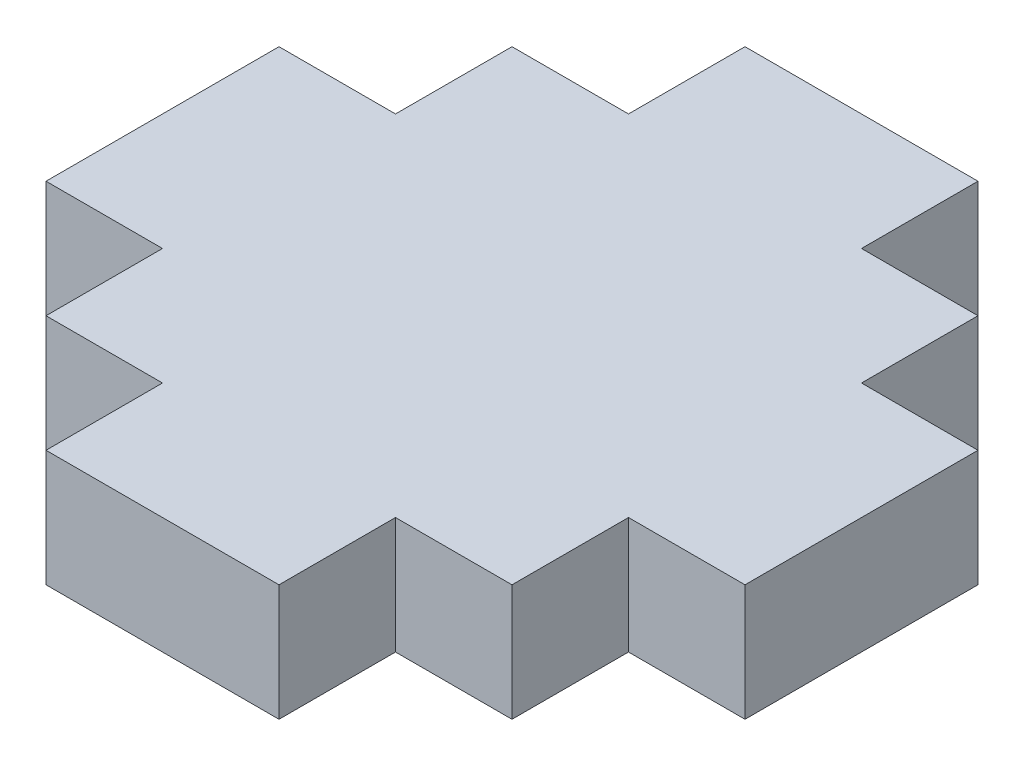
ISO-10303-21;
HEADER;
FILE_DESCRIPTION(('STEP AP214'),'2;1');
FILE_NAME('part.step','',(''),(''),'','','');
FILE_SCHEMA(('AUTOMOTIVE_DESIGN { 1 0 10303 214 1 1 1 1 }'));
ENDSEC;
DATA;
#1=APPLICATION_CONTEXT('core data for automotive mechanical design processes');
#2=APPLICATION_PROTOCOL_DEFINITION('international standard','automotive_design',2000,#1);
#3=PRODUCT_CONTEXT('',#1,'mechanical');
#4=PRODUCT('Part','Part','',(#3));
#5=PRODUCT_RELATED_PRODUCT_CATEGORY('part','',(#4));
#6=PRODUCT_DEFINITION_FORMATION('','',#4);
#7=PRODUCT_DEFINITION_CONTEXT('part definition',#1,'design');
#8=PRODUCT_DEFINITION('design','',#6,#7);
#9=PRODUCT_DEFINITION_SHAPE('','',#8);
#10=(LENGTH_UNIT() NAMED_UNIT(*) SI_UNIT(.MILLI.,.METRE.));
#11=(NAMED_UNIT(*) PLANE_ANGLE_UNIT() SI_UNIT($,.RADIAN.));
#12=(NAMED_UNIT(*) SI_UNIT($,.STERADIAN.) SOLID_ANGLE_UNIT());
#13=UNCERTAINTY_MEASURE_WITH_UNIT(LENGTH_MEASURE(1.E-05),#10,'distance_accuracy_value','');
#14=(GEOMETRIC_REPRESENTATION_CONTEXT(3) GLOBAL_UNCERTAINTY_ASSIGNED_CONTEXT((#13)) GLOBAL_UNIT_ASSIGNED_CONTEXT((#10,
#11,#12)) REPRESENTATION_CONTEXT('',''));
#15=CARTESIAN_POINT('',(0.,0.,0.));
#16=DIRECTION('',(0.,0.,1.));
#17=DIRECTION('',(1.,0.,0.));
#18=AXIS2_PLACEMENT_3D('',#15,#16,#17);
#19=CARTESIAN_POINT('',(6.,1.5,-6.));
#20=DIRECTION('',(-1.,0.,0.));
#21=DIRECTION('',(0.,0.,1.));
#22=AXIS2_PLACEMENT_3D('',#19,#20,#21);
#23=PLANE('',#22);
#24=DIRECTION('',(0.,-1.,0.));
#25=VECTOR('',#24,1.);
#26=CARTESIAN_POINT('',(6.,1.5,3.));
#27=LINE('',#26,#25);
#28=CARTESIAN_POINT('',(6.,1.5,3.));
#29=VERTEX_POINT('',#28);
#30=CARTESIAN_POINT('',(6.,-1.5,3.));
#31=VERTEX_POINT('',#30);
#32=EDGE_CURVE('E192',#29,#31,#27,.T.);
#33=ORIENTED_EDGE('',*,*,#32,.F.);
#34=DIRECTION('',(0.,0.,-1.));
#35=VECTOR('',#34,1.);
#36=CARTESIAN_POINT('',(6.,1.5,-6.));
#37=LINE('',#36,#35);
#38=CARTESIAN_POINT('',(6.,1.5,6.));
#39=VERTEX_POINT('',#38);
#40=EDGE_CURVE('E198',#39,#29,#37,.T.);
#41=ORIENTED_EDGE('',*,*,#40,.F.);
#42=DIRECTION('',(0.,-1.,0.));
#43=VECTOR('',#42,1.);
#44=CARTESIAN_POINT('',(6.,1.5,6.));
#45=LINE('',#44,#43);
#46=CARTESIAN_POINT('',(6.,-1.5,6.));
#47=VERTEX_POINT('',#46);
#48=EDGE_CURVE('E42',#39,#47,#45,.T.);
#49=ORIENTED_EDGE('',*,*,#48,.T.);
#50=DIRECTION('',(0.,0.,-1.));
#51=VECTOR('',#50,1.);
#52=CARTESIAN_POINT('',(6.,-1.5,-6.));
#53=LINE('',#52,#51);
#54=EDGE_CURVE('E220',#47,#31,#53,.T.);
#55=ORIENTED_EDGE('',*,*,#54,.T.);
#56=EDGE_LOOP('',(#33,#41,#49,#55));
#57=FACE_BOUND('',#56,.T.);
#58=ADVANCED_FACE('F34',(#57),#23,.F.);
#59=CARTESIAN_POINT('',(-6.,1.5,-6.));
#60=DIRECTION('',(1.,0.,0.));
#61=DIRECTION('',(0.,0.,-1.));
#62=AXIS2_PLACEMENT_3D('',#59,#60,#61);
#63=PLANE('',#62);
#64=DIRECTION('',(0.,-1.,0.));
#65=VECTOR('',#64,1.);
#66=CARTESIAN_POINT('',(-6.,1.5,-3.));
#67=LINE('',#66,#65);
#68=CARTESIAN_POINT('',(-6.,1.5,-3.));
#69=VERTEX_POINT('',#68);
#70=CARTESIAN_POINT('',(-6.,-1.5,-3.));
#71=VERTEX_POINT('',#70);
#72=EDGE_CURVE('E276',#69,#71,#67,.T.);
#73=ORIENTED_EDGE('',*,*,#72,.F.);
#74=DIRECTION('',(0.,0.,1.));
#75=VECTOR('',#74,1.);
#76=CARTESIAN_POINT('',(-6.,1.5,-6.));
#77=LINE('',#76,#75);
#78=CARTESIAN_POINT('',(-6.,1.5,-6.));
#79=VERTEX_POINT('',#78);
#80=EDGE_CURVE('E325',#79,#69,#77,.T.);
#81=ORIENTED_EDGE('',*,*,#80,.F.);
#82=DIRECTION('',(0.,-1.,0.));
#83=VECTOR('',#82,1.);
#84=CARTESIAN_POINT('',(-6.,1.5,-6.));
#85=LINE('',#84,#83);
#86=CARTESIAN_POINT('',(-6.,-1.5,-6.));
#87=VERTEX_POINT('',#86);
#88=EDGE_CURVE('E210',#79,#87,#85,.T.);
#89=ORIENTED_EDGE('',*,*,#88,.T.);
#90=DIRECTION('',(0.,0.,1.));
#91=VECTOR('',#90,1.);
#92=CARTESIAN_POINT('',(-6.,-1.5,-6.));
#93=LINE('',#92,#91);
#94=EDGE_CURVE('E211',#87,#71,#93,.T.);
#95=ORIENTED_EDGE('',*,*,#94,.T.);
#96=EDGE_LOOP('',(#73,#81,#89,#95));
#97=FACE_BOUND('',#96,.T.);
#98=ADVANCED_FACE('F379',(#97),#63,.F.);
#99=CARTESIAN_POINT('',(-6.,1.5,6.));
#100=DIRECTION('',(0.,0.,-1.));
#101=DIRECTION('',(-1.,0.,0.));
#102=AXIS2_PLACEMENT_3D('',#99,#100,#101);
#103=PLANE('',#102);
#104=DIRECTION('',(0.,-1.,0.));
#105=VECTOR('',#104,1.);
#106=CARTESIAN_POINT('',(-3.,1.5,6.));
#107=LINE('',#106,#105);
#108=CARTESIAN_POINT('',(-3.,1.5,6.));
#109=VERTEX_POINT('',#108);
#110=CARTESIAN_POINT('',(-3.,-1.5,6.));
#111=VERTEX_POINT('',#110);
#112=EDGE_CURVE('E300',#109,#111,#107,.T.);
#113=ORIENTED_EDGE('',*,*,#112,.F.);
#114=DIRECTION('',(1.,0.,0.));
#115=VECTOR('',#114,1.);
#116=CARTESIAN_POINT('',(-6.,1.5,6.));
#117=LINE('',#116,#115);
#118=CARTESIAN_POINT('',(-6.,1.5,6.));
#119=VERTEX_POINT('',#118);
#120=EDGE_CURVE('E199',#119,#109,#117,.T.);
#121=ORIENTED_EDGE('',*,*,#120,.F.);
#122=DIRECTION('',(0.,-1.,0.));
#123=VECTOR('',#122,1.);
#124=CARTESIAN_POINT('',(-6.,1.5,6.));
#125=LINE('',#124,#123);
#126=CARTESIAN_POINT('',(-6.,-1.5,6.));
#127=VERTEX_POINT('',#126);
#128=EDGE_CURVE('E11',#119,#127,#125,.T.);
#129=ORIENTED_EDGE('',*,*,#128,.T.);
#130=DIRECTION('',(1.,0.,0.));
#131=VECTOR('',#130,1.);
#132=CARTESIAN_POINT('',(-6.,-1.5,6.));
#133=LINE('',#132,#131);
#134=EDGE_CURVE('E216',#127,#111,#133,.T.);
#135=ORIENTED_EDGE('',*,*,#134,.T.);
#136=EDGE_LOOP('',(#113,#121,#129,#135));
#137=FACE_BOUND('',#136,.T.);
#138=ADVANCED_FACE('F334',(#137),#103,.F.);
#139=CARTESIAN_POINT('',(-6.,1.5,-6.));
#140=DIRECTION('',(0.,0.,1.));
#141=DIRECTION('',(1.,0.,0.));
#142=AXIS2_PLACEMENT_3D('',#139,#140,#141);
#143=PLANE('',#142);
#144=DIRECTION('',(0.,-1.,0.));
#145=VECTOR('',#144,1.);
#146=CARTESIAN_POINT('',(3.,1.5,-6.));
#147=LINE('',#146,#145);
#148=CARTESIAN_POINT('',(3.,1.5,-6.));
#149=VERTEX_POINT('',#148);
#150=CARTESIAN_POINT('',(3.,-1.5,-6.));
#151=VERTEX_POINT('',#150);
#152=EDGE_CURVE('E321',#149,#151,#147,.T.);
#153=ORIENTED_EDGE('',*,*,#152,.F.);
#154=DIRECTION('',(-1.,0.,0.));
#155=VECTOR('',#154,1.);
#156=CARTESIAN_POINT('',(-6.,1.5,-6.));
#157=LINE('',#156,#155);
#158=CARTESIAN_POINT('',(6.,1.5,-6.));
#159=VERTEX_POINT('',#158);
#160=EDGE_CURVE('E208',#159,#149,#157,.T.);
#161=ORIENTED_EDGE('',*,*,#160,.F.);
#162=DIRECTION('',(0.,-1.,0.));
#163=VECTOR('',#162,1.);
#164=CARTESIAN_POINT('',(6.,1.5,-6.));
#165=LINE('',#164,#163);
#166=CARTESIAN_POINT('',(6.,-1.5,-6.));
#167=VERTEX_POINT('',#166);
#168=EDGE_CURVE('E196',#159,#167,#165,.T.);
#169=ORIENTED_EDGE('',*,*,#168,.T.);
#170=DIRECTION('',(-1.,0.,0.));
#171=VECTOR('',#170,1.);
#172=CARTESIAN_POINT('',(-6.,-1.5,-6.));
#173=LINE('',#172,#171);
#174=EDGE_CURVE('E224',#167,#151,#173,.T.);
#175=ORIENTED_EDGE('',*,*,#174,.T.);
#176=EDGE_LOOP('',(#153,#161,#169,#175));
#177=FACE_BOUND('',#176,.T.);
#178=ADVANCED_FACE('F358',(#177),#143,.F.);
#179=CARTESIAN_POINT('',(-6.,1.5,3.));
#180=VERTEX_POINT('',#179);
#181=EDGE_CURVE('E227',#180,#119,#77,.T.);
#182=ORIENTED_EDGE('',*,*,#181,.F.);
#183=DIRECTION('',(0.,-1.,0.));
#184=VECTOR('',#183,1.);
#185=CARTESIAN_POINT('',(-6.,1.5,3.));
#186=LINE('',#185,#184);
#187=CARTESIAN_POINT('',(-6.,-1.5,3.));
#188=VERTEX_POINT('',#187);
#189=EDGE_CURVE('E265',#180,#188,#186,.T.);
#190=ORIENTED_EDGE('',*,*,#189,.T.);
#191=EDGE_CURVE('E215',#188,#127,#93,.T.);
#192=ORIENTED_EDGE('',*,*,#191,.T.);
#193=ORIENTED_EDGE('',*,*,#128,.F.);
#194=EDGE_LOOP('',(#182,#190,#192,#193));
#195=FACE_BOUND('',#194,.T.);
#196=ADVANCED_FACE('F36',(#195),#63,.F.);
#197=CARTESIAN_POINT('',(3.,1.5,6.));
#198=VERTEX_POINT('',#197);
#199=EDGE_CURVE('E204',#198,#39,#117,.T.);
#200=ORIENTED_EDGE('',*,*,#199,.F.);
#201=DIRECTION('',(0.,-1.,0.));
#202=VECTOR('',#201,1.);
#203=CARTESIAN_POINT('',(3.,1.5,6.));
#204=LINE('',#203,#202);
#205=CARTESIAN_POINT('',(3.,-1.5,6.));
#206=VERTEX_POINT('',#205);
#207=EDGE_CURVE('E287',#198,#206,#204,.T.);
#208=ORIENTED_EDGE('',*,*,#207,.T.);
#209=EDGE_CURVE('E214',#206,#47,#133,.T.);
#210=ORIENTED_EDGE('',*,*,#209,.T.);
#211=ORIENTED_EDGE('',*,*,#48,.F.);
#212=EDGE_LOOP('',(#200,#208,#210,#211));
#213=FACE_BOUND('',#212,.T.);
#214=ADVANCED_FACE('F349',(#213),#103,.F.);
#215=CARTESIAN_POINT('',(6.,1.5,-3.));
#216=VERTEX_POINT('',#215);
#217=EDGE_CURVE('E179',#216,#159,#37,.T.);
#218=ORIENTED_EDGE('',*,*,#217,.F.);
#219=DIRECTION('',(0.,-1.,0.));
#220=VECTOR('',#219,1.);
#221=CARTESIAN_POINT('',(6.,1.5,-3.));
#222=LINE('',#221,#220);
#223=CARTESIAN_POINT('',(6.,-1.5,-3.));
#224=VERTEX_POINT('',#223);
#225=EDGE_CURVE('E187',#216,#224,#222,.T.);
#226=ORIENTED_EDGE('',*,*,#225,.T.);
#227=EDGE_CURVE('E219',#224,#167,#53,.T.);
#228=ORIENTED_EDGE('',*,*,#227,.T.);
#229=ORIENTED_EDGE('',*,*,#168,.F.);
#230=EDGE_LOOP('',(#218,#226,#228,#229));
#231=FACE_BOUND('',#230,.T.);
#232=ADVANCED_FACE('F194',(#231),#23,.F.);
#233=CARTESIAN_POINT('',(-3.,1.5,-6.));
#234=VERTEX_POINT('',#233);
#235=EDGE_CURVE('E202',#234,#79,#157,.T.);
#236=ORIENTED_EDGE('',*,*,#235,.F.);
#237=DIRECTION('',(0.,-1.,0.));
#238=VECTOR('',#237,1.);
#239=CARTESIAN_POINT('',(-3.,1.5,-6.));
#240=LINE('',#239,#238);
#241=CARTESIAN_POINT('',(-3.,-1.5,-6.));
#242=VERTEX_POINT('',#241);
#243=EDGE_CURVE('E323',#234,#242,#240,.T.);
#244=ORIENTED_EDGE('',*,*,#243,.T.);
#245=EDGE_CURVE('E223',#242,#87,#173,.T.);
#246=ORIENTED_EDGE('',*,*,#245,.T.);
#247=ORIENTED_EDGE('',*,*,#88,.F.);
#248=EDGE_LOOP('',(#236,#244,#246,#247));
#249=FACE_BOUND('',#248,.T.);
#250=ADVANCED_FACE('F375',(#249),#143,.F.);
#251=CARTESIAN_POINT('',(0.,1.5,0.));
#252=DIRECTION('',(0.,1.,0.));
#253=DIRECTION('',(0.,0.,1.));
#254=AXIS2_PLACEMENT_3D('',#251,#252,#253);
#255=PLANE('',#254);
#256=ORIENTED_EDGE('',*,*,#80,.T.);
#257=DIRECTION('',(-1.,0.,0.));
#258=VECTOR('',#257,1.);
#259=CARTESIAN_POINT('',(-6.,1.5,-3.));
#260=LINE('',#259,#258);
#261=CARTESIAN_POINT('',(-9.,1.5,-3.));
#262=VERTEX_POINT('',#261);
#263=EDGE_CURVE('E259',#69,#262,#260,.T.);
#264=ORIENTED_EDGE('',*,*,#263,.T.);
#265=DIRECTION('',(0.,0.,1.));
#266=VECTOR('',#265,1.);
#267=CARTESIAN_POINT('',(-9.,1.5,-3.));
#268=LINE('',#267,#266);
#269=CARTESIAN_POINT('',(-9.,1.5,3.));
#270=VERTEX_POINT('',#269);
#271=EDGE_CURVE('E261',#262,#270,#268,.T.);
#272=ORIENTED_EDGE('',*,*,#271,.T.);
#273=DIRECTION('',(1.,0.,0.));
#274=VECTOR('',#273,1.);
#275=CARTESIAN_POINT('',(-6.,1.5,3.));
#276=LINE('',#275,#274);
#277=EDGE_CURVE('E263',#270,#180,#276,.T.);
#278=ORIENTED_EDGE('',*,*,#277,.T.);
#279=ORIENTED_EDGE('',*,*,#181,.T.);
#280=ORIENTED_EDGE('',*,*,#120,.T.);
#281=DIRECTION('',(0.,0.,1.));
#282=VECTOR('',#281,1.);
#283=CARTESIAN_POINT('',(-3.,1.5,6.));
#284=LINE('',#283,#282);
#285=CARTESIAN_POINT('',(-3.,1.5,9.));
#286=VERTEX_POINT('',#285);
#287=EDGE_CURVE('E280',#109,#286,#284,.T.);
#288=ORIENTED_EDGE('',*,*,#287,.T.);
#289=DIRECTION('',(1.,0.,0.));
#290=VECTOR('',#289,1.);
#291=CARTESIAN_POINT('',(-3.,1.5,9.));
#292=LINE('',#291,#290);
#293=CARTESIAN_POINT('',(3.,1.5,9.));
#294=VERTEX_POINT('',#293);
#295=EDGE_CURVE('E282',#286,#294,#292,.T.);
#296=ORIENTED_EDGE('',*,*,#295,.T.);
#297=DIRECTION('',(0.,0.,-1.));
#298=VECTOR('',#297,1.);
#299=CARTESIAN_POINT('',(3.,1.5,6.));
#300=LINE('',#299,#298);
#301=EDGE_CURVE('E285',#294,#198,#300,.T.);
#302=ORIENTED_EDGE('',*,*,#301,.T.);
#303=ORIENTED_EDGE('',*,*,#199,.T.);
#304=ORIENTED_EDGE('',*,*,#40,.T.);
#305=DIRECTION('',(1.,0.,0.));
#306=VECTOR('',#305,1.);
#307=CARTESIAN_POINT('',(6.,1.5,3.));
#308=LINE('',#307,#306);
#309=CARTESIAN_POINT('',(9.,1.5,3.));
#310=VERTEX_POINT('',#309);
#311=EDGE_CURVE('E184',#29,#310,#308,.T.);
#312=ORIENTED_EDGE('',*,*,#311,.T.);
#313=DIRECTION('',(0.,0.,-1.));
#314=VECTOR('',#313,1.);
#315=CARTESIAN_POINT('',(9.,1.5,-3.));
#316=LINE('',#315,#314);
#317=CARTESIAN_POINT('',(9.,1.5,-3.));
#318=VERTEX_POINT('',#317);
#319=EDGE_CURVE('E182',#310,#318,#316,.T.);
#320=ORIENTED_EDGE('',*,*,#319,.T.);
#321=DIRECTION('',(-1.,0.,0.));
#322=VECTOR('',#321,1.);
#323=CARTESIAN_POINT('',(6.,1.5,-3.));
#324=LINE('',#323,#322);
#325=EDGE_CURVE('E174',#318,#216,#324,.T.);
#326=ORIENTED_EDGE('',*,*,#325,.T.);
#327=ORIENTED_EDGE('',*,*,#217,.T.);
#328=ORIENTED_EDGE('',*,*,#160,.T.);
#329=DIRECTION('',(0.,0.,-1.));
#330=VECTOR('',#329,1.);
#331=CARTESIAN_POINT('',(3.,1.5,-6.));
#332=LINE('',#331,#330);
#333=CARTESIAN_POINT('',(3.,1.5,-9.));
#334=VERTEX_POINT('',#333);
#335=EDGE_CURVE('E306',#149,#334,#332,.T.);
#336=ORIENTED_EDGE('',*,*,#335,.T.);
#337=DIRECTION('',(-1.,0.,0.));
#338=VECTOR('',#337,1.);
#339=CARTESIAN_POINT('',(-3.,1.5,-9.));
#340=LINE('',#339,#338);
#341=CARTESIAN_POINT('',(-3.,1.5,-9.));
#342=VERTEX_POINT('',#341);
#343=EDGE_CURVE('E309',#334,#342,#340,.T.);
#344=ORIENTED_EDGE('',*,*,#343,.T.);
#345=DIRECTION('',(0.,0.,1.));
#346=VECTOR('',#345,1.);
#347=CARTESIAN_POINT('',(-3.,1.5,-6.));
#348=LINE('',#347,#346);
#349=EDGE_CURVE('E304',#342,#234,#348,.T.);
#350=ORIENTED_EDGE('',*,*,#349,.T.);
#351=ORIENTED_EDGE('',*,*,#235,.T.);
#352=EDGE_LOOP('',(#256,#264,#272,#278,#279,#280,#288,#296,#302,#303,#304,#312,#320,#326,#327,
#328,#336,#344,#350,#351));
#353=FACE_BOUND('',#352,.T.);
#354=ADVANCED_FACE('F176',(#353),#255,.T.);
#355=CARTESIAN_POINT('',(0.,-1.5,0.));
#356=DIRECTION('',(0.,1.,0.));
#357=DIRECTION('',(0.,0.,1.));
#358=AXIS2_PLACEMENT_3D('',#355,#356,#357);
#359=PLANE('',#358);
#360=ORIENTED_EDGE('',*,*,#94,.F.);
#361=ORIENTED_EDGE('',*,*,#245,.F.);
#362=DIRECTION('',(0.,0.,1.));
#363=VECTOR('',#362,1.);
#364=CARTESIAN_POINT('',(-3.,-1.5,-6.));
#365=LINE('',#364,#363);
#366=CARTESIAN_POINT('',(-3.,-1.5,-9.));
#367=VERTEX_POINT('',#366);
#368=EDGE_CURVE('E303',#367,#242,#365,.T.);
#369=ORIENTED_EDGE('',*,*,#368,.F.);
#370=DIRECTION('',(-1.,0.,0.));
#371=VECTOR('',#370,1.);
#372=CARTESIAN_POINT('',(-3.,-1.5,-9.));
#373=LINE('',#372,#371);
#374=CARTESIAN_POINT('',(3.,-1.5,-9.));
#375=VERTEX_POINT('',#374);
#376=EDGE_CURVE('E307',#375,#367,#373,.T.);
#377=ORIENTED_EDGE('',*,*,#376,.F.);
#378=DIRECTION('',(0.,0.,-1.));
#379=VECTOR('',#378,1.);
#380=CARTESIAN_POINT('',(3.,-1.5,-6.));
#381=LINE('',#380,#379);
#382=EDGE_CURVE('E313',#151,#375,#381,.T.);
#383=ORIENTED_EDGE('',*,*,#382,.F.);
#384=ORIENTED_EDGE('',*,*,#174,.F.);
#385=ORIENTED_EDGE('',*,*,#227,.F.);
#386=DIRECTION('',(-1.,0.,0.));
#387=VECTOR('',#386,1.);
#388=CARTESIAN_POINT('',(6.,-1.5,-3.));
#389=LINE('',#388,#387);
#390=CARTESIAN_POINT('',(9.,-1.5,-3.));
#391=VERTEX_POINT('',#390);
#392=EDGE_CURVE('E49',#391,#224,#389,.T.);
#393=ORIENTED_EDGE('',*,*,#392,.F.);
#394=DIRECTION('',(0.,0.,-1.));
#395=VECTOR('',#394,1.);
#396=CARTESIAN_POINT('',(9.,-1.5,-3.));
#397=LINE('',#396,#395);
#398=CARTESIAN_POINT('',(9.,-1.5,3.));
#399=VERTEX_POINT('',#398);
#400=EDGE_CURVE('E185',#399,#391,#397,.T.);
#401=ORIENTED_EDGE('',*,*,#400,.F.);
#402=DIRECTION('',(1.,0.,0.));
#403=VECTOR('',#402,1.);
#404=CARTESIAN_POINT('',(6.,-1.5,3.));
#405=LINE('',#404,#403);
#406=EDGE_CURVE('E245',#31,#399,#405,.T.);
#407=ORIENTED_EDGE('',*,*,#406,.F.);
#408=ORIENTED_EDGE('',*,*,#54,.F.);
#409=ORIENTED_EDGE('',*,*,#209,.F.);
#410=DIRECTION('',(0.,0.,-1.));
#411=VECTOR('',#410,1.);
#412=CARTESIAN_POINT('',(3.,-1.5,6.));
#413=LINE('',#412,#411);
#414=CARTESIAN_POINT('',(3.,-1.5,9.));
#415=VERTEX_POINT('',#414);
#416=EDGE_CURVE('E283',#415,#206,#413,.T.);
#417=ORIENTED_EDGE('',*,*,#416,.F.);
#418=DIRECTION('',(1.,0.,0.));
#419=VECTOR('',#418,1.);
#420=CARTESIAN_POINT('',(-3.,-1.5,9.));
#421=LINE('',#420,#419);
#422=CARTESIAN_POINT('',(-3.,-1.5,9.));
#423=VERTEX_POINT('',#422);
#424=EDGE_CURVE('E289',#423,#415,#421,.T.);
#425=ORIENTED_EDGE('',*,*,#424,.F.);
#426=DIRECTION('',(0.,0.,1.));
#427=VECTOR('',#426,1.);
#428=CARTESIAN_POINT('',(-3.,-1.5,6.));
#429=LINE('',#428,#427);
#430=EDGE_CURVE('E279',#111,#423,#429,.T.);
#431=ORIENTED_EDGE('',*,*,#430,.F.);
#432=ORIENTED_EDGE('',*,*,#134,.F.);
#433=ORIENTED_EDGE('',*,*,#191,.F.);
#434=DIRECTION('',(1.,0.,0.));
#435=VECTOR('',#434,1.);
#436=CARTESIAN_POINT('',(-6.,-1.5,3.));
#437=LINE('',#436,#435);
#438=CARTESIAN_POINT('',(-9.,-1.5,3.));
#439=VERTEX_POINT('',#438);
#440=EDGE_CURVE('E57',#439,#188,#437,.T.);
#441=ORIENTED_EDGE('',*,*,#440,.F.);
#442=DIRECTION('',(0.,0.,1.));
#443=VECTOR('',#442,1.);
#444=CARTESIAN_POINT('',(-9.,-1.5,-3.));
#445=LINE('',#444,#443);
#446=CARTESIAN_POINT('',(-9.,-1.5,-3.));
#447=VERTEX_POINT('',#446);
#448=EDGE_CURVE('E267',#447,#439,#445,.T.);
#449=ORIENTED_EDGE('',*,*,#448,.F.);
#450=DIRECTION('',(-1.,0.,0.));
#451=VECTOR('',#450,1.);
#452=CARTESIAN_POINT('',(-6.,-1.5,-3.));
#453=LINE('',#452,#451);
#454=EDGE_CURVE('E191',#71,#447,#453,.T.);
#455=ORIENTED_EDGE('',*,*,#454,.F.);
#456=EDGE_LOOP('',(#360,#361,#369,#377,#383,#384,#385,#393,#401,#407,#408,#409,#417,#425,#431,
#432,#433,#441,#449,#455));
#457=FACE_BOUND('',#456,.T.);
#458=ADVANCED_FACE('F242',(#457),#359,.F.);
#459=CARTESIAN_POINT('',(-3.,1.5,-6.));
#460=DIRECTION('',(1.,0.,0.));
#461=DIRECTION('',(0.,0.,-1.));
#462=AXIS2_PLACEMENT_3D('',#459,#460,#461);
#463=PLANE('',#462);
#464=ORIENTED_EDGE('',*,*,#368,.T.);
#465=ORIENTED_EDGE('',*,*,#243,.F.);
#466=ORIENTED_EDGE('',*,*,#349,.F.);
#467=DIRECTION('',(0.,-1.,0.));
#468=VECTOR('',#467,1.);
#469=CARTESIAN_POINT('',(-3.,1.5,-9.));
#470=LINE('',#469,#468);
#471=EDGE_CURVE('E311',#342,#367,#470,.T.);
#472=ORIENTED_EDGE('',*,*,#471,.T.);
#473=EDGE_LOOP('',(#464,#465,#466,#472));
#474=FACE_BOUND('',#473,.T.);
#475=ADVANCED_FACE('F371',(#474),#463,.F.);
#476=CARTESIAN_POINT('',(3.,1.5,-6.));
#477=DIRECTION('',(-1.,0.,0.));
#478=DIRECTION('',(0.,0.,1.));
#479=AXIS2_PLACEMENT_3D('',#476,#477,#478);
#480=PLANE('',#479);
#481=ORIENTED_EDGE('',*,*,#382,.T.);
#482=DIRECTION('',(0.,-1.,0.));
#483=VECTOR('',#482,1.);
#484=CARTESIAN_POINT('',(3.,1.5,-9.));
#485=LINE('',#484,#483);
#486=EDGE_CURVE('E318',#334,#375,#485,.T.);
#487=ORIENTED_EDGE('',*,*,#486,.F.);
#488=ORIENTED_EDGE('',*,*,#335,.F.);
#489=ORIENTED_EDGE('',*,*,#152,.T.);
#490=EDGE_LOOP('',(#481,#487,#488,#489));
#491=FACE_BOUND('',#490,.T.);
#492=ADVANCED_FACE('F363',(#491),#480,.F.);
#493=CARTESIAN_POINT('',(-3.,1.5,-9.));
#494=DIRECTION('',(0.,0.,1.));
#495=DIRECTION('',(1.,0.,0.));
#496=AXIS2_PLACEMENT_3D('',#493,#494,#495);
#497=PLANE('',#496);
#498=ORIENTED_EDGE('',*,*,#376,.T.);
#499=ORIENTED_EDGE('',*,*,#471,.F.);
#500=ORIENTED_EDGE('',*,*,#343,.F.);
#501=ORIENTED_EDGE('',*,*,#486,.T.);
#502=EDGE_LOOP('',(#498,#499,#500,#501));
#503=FACE_BOUND('',#502,.T.);
#504=ADVANCED_FACE('F366',(#503),#497,.F.);
#505=CARTESIAN_POINT('',(-3.,1.5,6.));
#506=DIRECTION('',(1.,0.,0.));
#507=DIRECTION('',(0.,0.,-1.));
#508=AXIS2_PLACEMENT_3D('',#505,#506,#507);
#509=PLANE('',#508);
#510=ORIENTED_EDGE('',*,*,#430,.T.);
#511=DIRECTION('',(0.,-1.,0.));
#512=VECTOR('',#511,1.);
#513=CARTESIAN_POINT('',(-3.,1.5,9.));
#514=LINE('',#513,#512);
#515=EDGE_CURVE('E297',#286,#423,#514,.T.);
#516=ORIENTED_EDGE('',*,*,#515,.F.);
#517=ORIENTED_EDGE('',*,*,#287,.F.);
#518=ORIENTED_EDGE('',*,*,#112,.T.);
#519=EDGE_LOOP('',(#510,#516,#517,#518));
#520=FACE_BOUND('',#519,.T.);
#521=ADVANCED_FACE('F340',(#520),#509,.F.);
#522=CARTESIAN_POINT('',(-3.,1.5,9.));
#523=DIRECTION('',(0.,0.,-1.));
#524=DIRECTION('',(-1.,0.,0.));
#525=AXIS2_PLACEMENT_3D('',#522,#523,#524);
#526=PLANE('',#525);
#527=ORIENTED_EDGE('',*,*,#424,.T.);
#528=DIRECTION('',(0.,-1.,0.));
#529=VECTOR('',#528,1.);
#530=CARTESIAN_POINT('',(3.,1.5,9.));
#531=LINE('',#530,#529);
#532=EDGE_CURVE('E294',#294,#415,#531,.T.);
#533=ORIENTED_EDGE('',*,*,#532,.F.);
#534=ORIENTED_EDGE('',*,*,#295,.F.);
#535=ORIENTED_EDGE('',*,*,#515,.T.);
#536=EDGE_LOOP('',(#527,#533,#534,#535));
#537=FACE_BOUND('',#536,.T.);
#538=ADVANCED_FACE('F346',(#537),#526,.F.);
#539=CARTESIAN_POINT('',(3.,1.5,6.));
#540=DIRECTION('',(-1.,0.,0.));
#541=DIRECTION('',(0.,0.,1.));
#542=AXIS2_PLACEMENT_3D('',#539,#540,#541);
#543=PLANE('',#542);
#544=ORIENTED_EDGE('',*,*,#416,.T.);
#545=ORIENTED_EDGE('',*,*,#207,.F.);
#546=ORIENTED_EDGE('',*,*,#301,.F.);
#547=ORIENTED_EDGE('',*,*,#532,.T.);
#548=EDGE_LOOP('',(#544,#545,#546,#547));
#549=FACE_BOUND('',#548,.T.);
#550=ADVANCED_FACE('F348',(#549),#543,.F.);
#551=CARTESIAN_POINT('',(-6.,1.5,-3.));
#552=DIRECTION('',(0.,0.,1.));
#553=DIRECTION('',(1.,0.,0.));
#554=AXIS2_PLACEMENT_3D('',#551,#552,#553);
#555=PLANE('',#554);
#556=ORIENTED_EDGE('',*,*,#454,.T.);
#557=DIRECTION('',(0.,-1.,0.));
#558=VECTOR('',#557,1.);
#559=CARTESIAN_POINT('',(-9.,1.5,-3.));
#560=LINE('',#559,#558);
#561=EDGE_CURVE('E273',#262,#447,#560,.T.);
#562=ORIENTED_EDGE('',*,*,#561,.F.);
#563=ORIENTED_EDGE('',*,*,#263,.F.);
#564=ORIENTED_EDGE('',*,*,#72,.T.);
#565=EDGE_LOOP('',(#556,#562,#563,#564));
#566=FACE_BOUND('',#565,.T.);
#567=ADVANCED_FACE('F381',(#566),#555,.F.);
#568=CARTESIAN_POINT('',(-9.,1.5,-3.));
#569=DIRECTION('',(1.,0.,0.));
#570=DIRECTION('',(0.,0.,-1.));
#571=AXIS2_PLACEMENT_3D('',#568,#569,#570);
#572=PLANE('',#571);
#573=ORIENTED_EDGE('',*,*,#448,.T.);
#574=DIRECTION('',(0.,-1.,0.));
#575=VECTOR('',#574,1.);
#576=CARTESIAN_POINT('',(-9.,1.5,3.));
#577=LINE('',#576,#575);
#578=EDGE_CURVE('E271',#270,#439,#577,.T.);
#579=ORIENTED_EDGE('',*,*,#578,.F.);
#580=ORIENTED_EDGE('',*,*,#271,.F.);
#581=ORIENTED_EDGE('',*,*,#561,.T.);
#582=EDGE_LOOP('',(#573,#579,#580,#581));
#583=FACE_BOUND('',#582,.T.);
#584=ADVANCED_FACE('F386',(#583),#572,.F.);
#585=CARTESIAN_POINT('',(-6.,1.5,3.));
#586=DIRECTION('',(0.,0.,-1.));
#587=DIRECTION('',(-1.,0.,0.));
#588=AXIS2_PLACEMENT_3D('',#585,#586,#587);
#589=PLANE('',#588);
#590=ORIENTED_EDGE('',*,*,#440,.T.);
#591=ORIENTED_EDGE('',*,*,#189,.F.);
#592=ORIENTED_EDGE('',*,*,#277,.F.);
#593=ORIENTED_EDGE('',*,*,#578,.T.);
#594=EDGE_LOOP('',(#590,#591,#592,#593));
#595=FACE_BOUND('',#594,.T.);
#596=ADVANCED_FACE('F388',(#595),#589,.F.);
#597=CARTESIAN_POINT('',(6.,1.5,-3.));
#598=DIRECTION('',(0.,0.,1.));
#599=DIRECTION('',(1.,0.,0.));
#600=AXIS2_PLACEMENT_3D('',#597,#598,#599);
#601=PLANE('',#600);
#602=ORIENTED_EDGE('',*,*,#392,.T.);
#603=ORIENTED_EDGE('',*,*,#225,.F.);
#604=ORIENTED_EDGE('',*,*,#325,.F.);
#605=DIRECTION('',(0.,-1.,0.));
#606=VECTOR('',#605,1.);
#607=CARTESIAN_POINT('',(9.,1.5,-3.));
#608=LINE('',#607,#606);
#609=EDGE_CURVE('E254',#318,#391,#608,.T.);
#610=ORIENTED_EDGE('',*,*,#609,.T.);
#611=EDGE_LOOP('',(#602,#603,#604,#610));
#612=FACE_BOUND('',#611,.T.);
#613=ADVANCED_FACE('F188',(#612),#601,.F.);
#614=CARTESIAN_POINT('',(6.,1.5,3.));
#615=DIRECTION('',(0.,0.,-1.));
#616=DIRECTION('',(-1.,0.,0.));
#617=AXIS2_PLACEMENT_3D('',#614,#615,#616);
#618=PLANE('',#617);
#619=ORIENTED_EDGE('',*,*,#406,.T.);
#620=DIRECTION('',(0.,-1.,0.));
#621=VECTOR('',#620,1.);
#622=CARTESIAN_POINT('',(9.,1.5,3.));
#623=LINE('',#622,#621);
#624=EDGE_CURVE('E256',#310,#399,#623,.T.);
#625=ORIENTED_EDGE('',*,*,#624,.F.);
#626=ORIENTED_EDGE('',*,*,#311,.F.);
#627=ORIENTED_EDGE('',*,*,#32,.T.);
#628=EDGE_LOOP('',(#619,#625,#626,#627));
#629=FACE_BOUND('',#628,.T.);
#630=ADVANCED_FACE('F351',(#629),#618,.F.);
#631=CARTESIAN_POINT('',(9.,1.5,-3.));
#632=DIRECTION('',(-1.,0.,0.));
#633=DIRECTION('',(0.,0.,1.));
#634=AXIS2_PLACEMENT_3D('',#631,#632,#633);
#635=PLANE('',#634);
#636=ORIENTED_EDGE('',*,*,#400,.T.);
#637=ORIENTED_EDGE('',*,*,#609,.F.);
#638=ORIENTED_EDGE('',*,*,#319,.F.);
#639=ORIENTED_EDGE('',*,*,#624,.T.);
#640=EDGE_LOOP('',(#636,#637,#638,#639));
#641=FACE_BOUND('',#640,.T.);
#642=ADVANCED_FACE('F353',(#641),#635,.F.);
#643=CLOSED_SHELL('',(#58,#98,#138,#178,#196,#214,#232,#250,#354,#458,#475,#492,#504,#521,#538,
#550,#567,#584,#596,#613,#630,#642));
#644=MANIFOLD_SOLID_BREP('B2',#643);
#645=ADVANCED_BREP_SHAPE_REPRESENTATION('',(#18,#644),#14);
#646=SHAPE_DEFINITION_REPRESENTATION(#9,#645);
ENDSEC;
END-ISO-10303-21;
